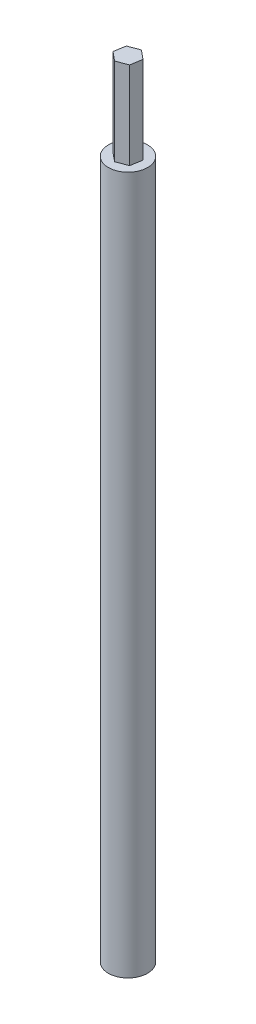
ISO-10303-21;
HEADER;
FILE_DESCRIPTION(('STEP AP214'),'2;1');
FILE_NAME('part.step','',(''),(''),'','','');
FILE_SCHEMA(('AUTOMOTIVE_DESIGN { 1 0 10303 214 1 1 1 1 }'));
ENDSEC;
DATA;
#1=APPLICATION_CONTEXT('core data for automotive mechanical design processes');
#2=APPLICATION_PROTOCOL_DEFINITION('international standard','automotive_design',2000,#1);
#3=PRODUCT_CONTEXT('',#1,'mechanical');
#4=PRODUCT('Part','Part','',(#3));
#5=PRODUCT_RELATED_PRODUCT_CATEGORY('part','',(#4));
#6=PRODUCT_DEFINITION_FORMATION('','',#4);
#7=PRODUCT_DEFINITION_CONTEXT('part definition',#1,'design');
#8=PRODUCT_DEFINITION('design','',#6,#7);
#9=PRODUCT_DEFINITION_SHAPE('','',#8);
#10=(LENGTH_UNIT() NAMED_UNIT(*) SI_UNIT(.MILLI.,.METRE.));
#11=(NAMED_UNIT(*) PLANE_ANGLE_UNIT() SI_UNIT($,.RADIAN.));
#12=(NAMED_UNIT(*) SI_UNIT($,.STERADIAN.) SOLID_ANGLE_UNIT());
#13=UNCERTAINTY_MEASURE_WITH_UNIT(LENGTH_MEASURE(1.E-05),#10,'distance_accuracy_value','');
#14=(GEOMETRIC_REPRESENTATION_CONTEXT(3) GLOBAL_UNCERTAINTY_ASSIGNED_CONTEXT((#13)) GLOBAL_UNIT_ASSIGNED_CONTEXT((#10,
#11,#12)) REPRESENTATION_CONTEXT('',''));
#15=CARTESIAN_POINT('',(0.,0.,0.));
#16=DIRECTION('',(0.,0.,1.));
#17=DIRECTION('',(1.,0.,0.));
#18=AXIS2_PLACEMENT_3D('',#15,#16,#17);
#19=CARTESIAN_POINT('',(0.,0.,0.));
#20=DIRECTION('',(0.,1.,0.));
#21=DIRECTION('',(0.,0.,1.));
#22=AXIS2_PLACEMENT_3D('',#19,#20,#21);
#23=PLANE('',#22);
#24=CARTESIAN_POINT('',(-16.1575589459084,0.,-16.1575589459085));
#25=DIRECTION('',(0.,1.,0.));
#26=DIRECTION('',(0.,0.,1.));
#27=AXIS2_PLACEMENT_3D('',#24,#25,#26);
#28=CIRCLE('',#27,4.5);
#29=CARTESIAN_POINT('',(-16.1575589459084,0.,-11.6575589459085));
#30=VERTEX_POINT('',#29);
#31=EDGE_CURVE('E47',#30,#30,#28,.T.);
#32=ORIENTED_EDGE('',*,*,#31,.F.);
#33=EDGE_LOOP('',(#32));
#34=FACE_BOUND('',#33,.T.);
#35=DIRECTION('',(1.,0.,0.));
#36=VECTOR('',#35,1.);
#37=CARTESIAN_POINT('',(0.,0.,-12.9075589459085));
#38=LINE('',#37,#36);
#39=CARTESIAN_POINT('',(-18.0339473207747,0.,-12.9075589459085));
#40=VERTEX_POINT('',#39);
#41=CARTESIAN_POINT('',(-14.2811705710422,0.,-12.9075589459085));
#42=VERTEX_POINT('',#41);
#43=EDGE_CURVE('E199',#40,#42,#38,.T.);
#44=ORIENTED_EDGE('',*,*,#43,.T.);
#45=DIRECTION('',(0.499999999999999,0.,-0.866025403784439));
#46=VECTOR('',#45,1.);
#47=CARTESIAN_POINT('',(-16.3000149022825,0.,-9.41081799162772));
#48=LINE('',#47,#46);
#49=CARTESIAN_POINT('',(-12.4047821961759,0.,-16.1575589459085));
#50=VERTEX_POINT('',#49);
#51=EDGE_CURVE('E204',#42,#50,#48,.T.);
#52=ORIENTED_EDGE('',*,*,#51,.T.);
#53=DIRECTION('',(-0.5,0.,-0.866025403784439));
#54=VECTOR('',#53,1.);
#55=CARTESIAN_POINT('',(-2.30715839198128,0.,1.3320385186735));
#56=LINE('',#55,#54);
#57=CARTESIAN_POINT('',(-14.2811705710422,0.,-19.4075589459085));
#58=VERTEX_POINT('',#57);
#59=EDGE_CURVE('E238',#50,#58,#56,.T.);
#60=ORIENTED_EDGE('',*,*,#59,.T.);
#61=DIRECTION('',(-1.,0.,0.));
#62=VECTOR('',#61,1.);
#63=CARTESIAN_POINT('',(0.,0.,-19.4075589459085));
#64=LINE('',#63,#62);
#65=CARTESIAN_POINT('',(-18.0339473207747,0.,-19.4075589459085));
#66=VERTEX_POINT('',#65);
#67=EDGE_CURVE('E242',#58,#66,#64,.T.);
#68=ORIENTED_EDGE('',*,*,#67,.T.);
#69=DIRECTION('',(-0.5,0.,0.866025403784439));
#70=VECTOR('',#69,1.);
#71=CARTESIAN_POINT('',(-21.9291800268814,0.,-12.6608179916277));
#72=LINE('',#71,#70);
#73=CARTESIAN_POINT('',(-19.910335695641,0.,-16.1575589459085));
#74=VERTEX_POINT('',#73);
#75=EDGE_CURVE('E246',#66,#74,#72,.T.);
#76=ORIENTED_EDGE('',*,*,#75,.T.);
#77=DIRECTION('',(0.5,0.,0.866025403784439));
#78=VECTOR('',#77,1.);
#79=CARTESIAN_POINT('',(-7.93632351658015,0.,4.5820385186735));
#80=LINE('',#79,#78);
#81=EDGE_CURVE('E215',#74,#40,#80,.T.);
#82=ORIENTED_EDGE('',*,*,#81,.T.);
#83=EDGE_LOOP('',(#44,#52,#60,#68,#76,#82));
#84=FACE_BOUND('',#83,.T.);
#85=ADVANCED_FACE('F43',(#34,#84),#23,.F.);
#86=CARTESIAN_POINT('',(-16.1575589459084,160.,-16.1575589459085));
#87=DIRECTION('',(0.,-1.,0.));
#88=DIRECTION('',(0.,0.,-1.));
#89=AXIS2_PLACEMENT_3D('',#86,#87,#88);
#90=CYLINDRICAL_SURFACE('',#89,4.5);
#91=CARTESIAN_POINT('',(-16.1575589459084,160.,-16.1575589459085));
#92=DIRECTION('',(0.,1.,0.));
#93=DIRECTION('',(0.,0.,1.));
#94=AXIS2_PLACEMENT_3D('',#91,#92,#93);
#95=CIRCLE('',#94,4.5);
#96=CARTESIAN_POINT('',(-16.1575589459084,160.,-11.6575589459085));
#97=VERTEX_POINT('',#96);
#98=EDGE_CURVE('E272',#97,#97,#95,.T.);
#99=ORIENTED_EDGE('',*,*,#98,.F.);
#100=EDGE_LOOP('',(#99));
#101=FACE_BOUND('',#100,.T.);
#102=ORIENTED_EDGE('',*,*,#31,.T.);
#103=EDGE_LOOP('',(#102));
#104=FACE_BOUND('',#103,.T.);
#105=ADVANCED_FACE('F45',(#101,#104),#90,.T.);
#106=CARTESIAN_POINT('',(-16.1575589459084,160.,-16.1575589459085));
#107=DIRECTION('',(0.,-1.,0.));
#108=DIRECTION('',(0.,0.,-1.));
#109=AXIS2_PLACEMENT_3D('',#106,#107,#108);
#110=CYLINDRICAL_SURFACE('',#109,2.31428571428571);
#111=CARTESIAN_POINT('',(-16.1575589459084,5.,-16.1575589459085));
#112=DIRECTION('',(0.,1.,0.));
#113=DIRECTION('',(0.,0.,1.));
#114=AXIS2_PLACEMENT_3D('',#111,#112,#113);
#115=CIRCLE('',#114,2.31428571428571);
#116=CARTESIAN_POINT('',(-16.1575589459084,5.,-13.8432732316228));
#117=VERTEX_POINT('',#116);
#118=EDGE_CURVE('E210',#117,#117,#115,.T.);
#119=ORIENTED_EDGE('',*,*,#118,.F.);
#120=EDGE_LOOP('',(#119));
#121=FACE_BOUND('',#120,.T.);
#122=CARTESIAN_POINT('',(-16.1575589459084,160.,-16.1575589459085));
#123=DIRECTION('',(0.,1.,0.));
#124=DIRECTION('',(0.,0.,1.));
#125=AXIS2_PLACEMENT_3D('',#122,#123,#124);
#126=CIRCLE('',#125,2.31428571428571);
#127=CARTESIAN_POINT('',(-15.3935069026118,160.,-13.9730354641209));
#128=VERTEX_POINT('',#127);
#129=CARTESIAN_POINT('',(-15.2912215587246,160.,-14.0115445240291));
#130=VERTEX_POINT('',#129);
#131=EDGE_CURVE('E276',#128,#130,#126,.T.);
#132=ORIENTED_EDGE('',*,*,#131,.T.);
#133=CARTESIAN_POINT('',(-13.8836800938685,160.,-15.726985684323));
#134=VERTEX_POINT('',#133);
#135=EDGE_CURVE('E280',#130,#134,#126,.T.);
#136=ORIENTED_EDGE('',*,*,#135,.T.);
#137=CARTESIAN_POINT('',(-13.8658872460812,160.,-15.8348219205183));
#138=VERTEX_POINT('',#137);
#139=EDGE_CURVE('E288',#134,#138,#126,.T.);
#140=ORIENTED_EDGE('',*,*,#139,.T.);
#141=CARTESIAN_POINT('',(-14.6477321371649,160.,-17.9115091661104));
#142=VERTEX_POINT('',#141);
#143=EDGE_CURVE('E317',#138,#142,#126,.T.);
#144=ORIENTED_EDGE('',*,*,#143,.T.);
#145=CARTESIAN_POINT('',(-14.7322246332653,160.,-17.9808363423978));
#146=VERTEX_POINT('',#145);
#147=EDGE_CURVE('E312',#142,#146,#126,.T.);
#148=ORIENTED_EDGE('',*,*,#147,.T.);
#149=CARTESIAN_POINT('',(-16.9216109892048,160.,-18.3420824276961));
#150=VERTEX_POINT('',#149);
#151=EDGE_CURVE('E309',#146,#150,#126,.T.);
#152=ORIENTED_EDGE('',*,*,#151,.T.);
#153=CARTESIAN_POINT('',(-17.0238963330926,160.,-18.3035733677877));
#154=VERTEX_POINT('',#153);
#155=EDGE_CURVE('E304',#150,#154,#126,.T.);
#156=ORIENTED_EDGE('',*,*,#155,.T.);
#157=CARTESIAN_POINT('',(-18.4314377979484,160.,-16.5881322074942));
#158=VERTEX_POINT('',#157);
#159=EDGE_CURVE('E301',#154,#158,#126,.T.);
#160=ORIENTED_EDGE('',*,*,#159,.T.);
#161=CARTESIAN_POINT('',(-18.4492306457358,160.,-16.4802959712984));
#162=VERTEX_POINT('',#161);
#163=EDGE_CURVE('E296',#158,#162,#126,.T.);
#164=ORIENTED_EDGE('',*,*,#163,.T.);
#165=CARTESIAN_POINT('',(-17.6673857546518,160.,-14.4036087257064));
#166=VERTEX_POINT('',#165);
#167=EDGE_CURVE('E293',#162,#166,#126,.T.);
#168=ORIENTED_EDGE('',*,*,#167,.T.);
#169=CARTESIAN_POINT('',(-17.5828932585518,160.,-14.3342815494193));
#170=VERTEX_POINT('',#169);
#171=EDGE_CURVE('E290',#166,#170,#126,.T.);
#172=ORIENTED_EDGE('',*,*,#171,.T.);
#173=EDGE_CURVE('E275',#170,#128,#126,.T.);
#174=ORIENTED_EDGE('',*,*,#173,.T.);
#175=EDGE_LOOP('',(#132,#136,#140,#144,#148,#152,#156,#160,#164,#168,#172,#174));
#176=FACE_BOUND('',#175,.T.);
#177=ADVANCED_FACE('F324',(#121,#176),#110,.F.);
#178=CARTESIAN_POINT('',(0.,160.,0.));
#179=DIRECTION('',(0.,1.,0.));
#180=DIRECTION('',(0.,0.,1.));
#181=AXIS2_PLACEMENT_3D('',#178,#179,#180);
#182=PLANE('',#181);
#183=DIRECTION('',(0.935870984996872,0.,-0.35234287198833));
#184=VECTOR('',#183,1.);
#185=CARTESIAN_POINT('',(-16.5924828428772,160.,-13.5216371057891));
#186=LINE('',#185,#184);
#187=CARTESIAN_POINT('',(-16.5924828428772,160.,-13.5216371057891));
#188=VERTEX_POINT('',#187);
#189=EDGE_CURVE('E333',#188,#128,#186,.T.);
#190=ORIENTED_EDGE('',*,*,#189,.F.);
#191=DIRECTION('',(0.773073370482697,0.,0.634316611677893));
#192=VECTOR('',#191,1.);
#193=CARTESIAN_POINT('',(-18.6577961703264,160.,-15.2162531693366));
#194=LINE('',#193,#192);
#195=EDGE_CURVE('E11',#170,#188,#194,.T.);
#196=ORIENTED_EDGE('',*,*,#195,.F.);
#197=ORIENTED_EDGE('',*,*,#171,.F.);
#198=CARTESIAN_POINT('',(-18.6577961703264,160.,-15.2162531693366));
#199=VERTEX_POINT('',#198);
#200=EDGE_CURVE('E55',#199,#166,#194,.T.);
#201=ORIENTED_EDGE('',*,*,#200,.F.);
#202=DIRECTION('',(-0.162797614514173,0.,0.986659483666221));
#203=VECTOR('',#202,1.);
#204=CARTESIAN_POINT('',(-18.2228722733577,160.,-17.852175009456));
#205=LINE('',#204,#203);
#206=EDGE_CURVE('E53',#162,#199,#205,.T.);
#207=ORIENTED_EDGE('',*,*,#206,.F.);
#208=ORIENTED_EDGE('',*,*,#163,.F.);
#209=CARTESIAN_POINT('',(-18.2228722733577,160.,-17.852175009456));
#210=VERTEX_POINT('',#209);
#211=EDGE_CURVE('E351',#210,#158,#205,.T.);
#212=ORIENTED_EDGE('',*,*,#211,.F.);
#213=DIRECTION('',(-0.935870984996872,0.,0.35234287198833));
#214=VECTOR('',#213,1.);
#215=CARTESIAN_POINT('',(-15.7226350489397,160.,-18.7934807860279));
#216=LINE('',#215,#214);
#217=EDGE_CURVE('E350',#154,#210,#216,.T.);
#218=ORIENTED_EDGE('',*,*,#217,.F.);
#219=ORIENTED_EDGE('',*,*,#155,.F.);
#220=CARTESIAN_POINT('',(-15.7226350489397,160.,-18.7934807860279));
#221=VERTEX_POINT('',#220);
#222=EDGE_CURVE('E345',#221,#150,#216,.T.);
#223=ORIENTED_EDGE('',*,*,#222,.F.);
#224=DIRECTION('',(-0.773073370482698,0.,-0.634316611677892));
#225=VECTOR('',#224,1.);
#226=CARTESIAN_POINT('',(-13.6573217214905,160.,-17.0988647224803));
#227=LINE('',#226,#225);
#228=EDGE_CURVE('E344',#146,#221,#227,.T.);
#229=ORIENTED_EDGE('',*,*,#228,.F.);
#230=ORIENTED_EDGE('',*,*,#147,.F.);
#231=CARTESIAN_POINT('',(-13.6573217214905,160.,-17.0988647224803));
#232=VERTEX_POINT('',#231);
#233=EDGE_CURVE('E340',#232,#142,#227,.T.);
#234=ORIENTED_EDGE('',*,*,#233,.F.);
#235=DIRECTION('',(0.162797614514173,0.,-0.986659483666222));
#236=VECTOR('',#235,1.);
#237=CARTESIAN_POINT('',(-14.0922456184592,160.,-14.4629428823609));
#238=LINE('',#237,#236);
#239=EDGE_CURVE('E279',#138,#232,#238,.T.);
#240=ORIENTED_EDGE('',*,*,#239,.F.);
#241=ORIENTED_EDGE('',*,*,#139,.F.);
#242=CARTESIAN_POINT('',(-14.0922456184592,160.,-14.4629428823609));
#243=VERTEX_POINT('',#242);
#244=EDGE_CURVE('E63',#243,#134,#238,.T.);
#245=ORIENTED_EDGE('',*,*,#244,.F.);
#246=EDGE_CURVE('E197',#130,#243,#186,.T.);
#247=ORIENTED_EDGE('',*,*,#246,.F.);
#248=ORIENTED_EDGE('',*,*,#131,.F.);
#249=EDGE_LOOP('',(#190,#196,#197,#201,#207,#208,#212,#218,#219,#223,#229,#230,#234,#240,#241,
#245,#247,#248));
#250=FACE_BOUND('',#249,.T.);
#251=ORIENTED_EDGE('',*,*,#98,.T.);
#252=EDGE_LOOP('',(#251));
#253=FACE_BOUND('',#252,.T.);
#254=ADVANCED_FACE('F405',(#250,#253),#182,.T.);
#255=CARTESIAN_POINT('',(0.,5.,-12.9075589459085));
#256=DIRECTION('',(0.,0.,-1.));
#257=DIRECTION('',(-1.,0.,0.));
#258=AXIS2_PLACEMENT_3D('',#255,#256,#257);
#259=PLANE('',#258);
#260=ORIENTED_EDGE('',*,*,#43,.F.);
#261=DIRECTION('',(0.,-1.,0.));
#262=VECTOR('',#261,1.);
#263=CARTESIAN_POINT('',(-18.0339473207747,5.,-12.9075589459085));
#264=LINE('',#263,#262);
#265=CARTESIAN_POINT('',(-18.0339473207747,5.,-12.9075589459085));
#266=VERTEX_POINT('',#265);
#267=EDGE_CURVE('E233',#266,#40,#264,.T.);
#268=ORIENTED_EDGE('',*,*,#267,.F.);
#269=DIRECTION('',(1.,0.,0.));
#270=VECTOR('',#269,1.);
#271=CARTESIAN_POINT('',(0.,5.,-12.9075589459085));
#272=LINE('',#271,#270);
#273=CARTESIAN_POINT('',(-14.2811705710422,5.,-12.9075589459085));
#274=VERTEX_POINT('',#273);
#275=EDGE_CURVE('E214',#266,#274,#272,.T.);
#276=ORIENTED_EDGE('',*,*,#275,.T.);
#277=DIRECTION('',(0.,-1.,0.));
#278=VECTOR('',#277,1.);
#279=CARTESIAN_POINT('',(-14.2811705710422,5.,-12.9075589459085));
#280=LINE('',#279,#278);
#281=EDGE_CURVE('E268',#274,#42,#280,.T.);
#282=ORIENTED_EDGE('',*,*,#281,.T.);
#283=EDGE_LOOP('',(#260,#268,#276,#282));
#284=FACE_BOUND('',#283,.T.);
#285=ADVANCED_FACE('F410',(#284),#259,.T.);
#286=CARTESIAN_POINT('',(-16.3000149022825,5.,-9.41081799162772));
#287=DIRECTION('',(-0.866025403784439,0.,-0.499999999999999));
#288=DIRECTION('',(-0.499999999999999,0.,0.866025403784439));
#289=AXIS2_PLACEMENT_3D('',#286,#287,#288);
#290=PLANE('',#289);
#291=ORIENTED_EDGE('',*,*,#51,.F.);
#292=ORIENTED_EDGE('',*,*,#281,.F.);
#293=DIRECTION('',(0.499999999999999,0.,-0.866025403784439));
#294=VECTOR('',#293,1.);
#295=CARTESIAN_POINT('',(-16.3000149022825,5.,-9.41081799162772));
#296=LINE('',#295,#294);
#297=CARTESIAN_POINT('',(-12.4047821961759,5.,-16.1575589459085));
#298=VERTEX_POINT('',#297);
#299=EDGE_CURVE('E219',#274,#298,#296,.T.);
#300=ORIENTED_EDGE('',*,*,#299,.T.);
#301=DIRECTION('',(0.,-1.,0.));
#302=VECTOR('',#301,1.);
#303=CARTESIAN_POINT('',(-12.4047821961759,5.,-16.1575589459085));
#304=LINE('',#303,#302);
#305=EDGE_CURVE('E265',#298,#50,#304,.T.);
#306=ORIENTED_EDGE('',*,*,#305,.T.);
#307=EDGE_LOOP('',(#291,#292,#300,#306));
#308=FACE_BOUND('',#307,.T.);
#309=ADVANCED_FACE('F438',(#308),#290,.T.);
#310=CARTESIAN_POINT('',(-2.30715839198128,5.,1.3320385186735));
#311=DIRECTION('',(-0.866025403784439,0.,0.5));
#312=DIRECTION('',(0.5,0.,0.866025403784439));
#313=AXIS2_PLACEMENT_3D('',#310,#311,#312);
#314=PLANE('',#313);
#315=ORIENTED_EDGE('',*,*,#59,.F.);
#316=ORIENTED_EDGE('',*,*,#305,.F.);
#317=DIRECTION('',(-0.5,0.,-0.866025403784439));
#318=VECTOR('',#317,1.);
#319=CARTESIAN_POINT('',(-2.30715839198128,5.,1.3320385186735));
#320=LINE('',#319,#318);
#321=CARTESIAN_POINT('',(-14.2811705710422,5.,-19.4075589459085));
#322=VERTEX_POINT('',#321);
#323=EDGE_CURVE('E222',#298,#322,#320,.T.);
#324=ORIENTED_EDGE('',*,*,#323,.T.);
#325=DIRECTION('',(0.,-1.,0.));
#326=VECTOR('',#325,1.);
#327=CARTESIAN_POINT('',(-14.2811705710422,5.,-19.4075589459085));
#328=LINE('',#327,#326);
#329=EDGE_CURVE('E262',#322,#58,#328,.T.);
#330=ORIENTED_EDGE('',*,*,#329,.T.);
#331=EDGE_LOOP('',(#315,#316,#324,#330));
#332=FACE_BOUND('',#331,.T.);
#333=ADVANCED_FACE('F442',(#332),#314,.T.);
#334=CARTESIAN_POINT('',(0.,5.,-19.4075589459085));
#335=DIRECTION('',(0.,0.,1.));
#336=DIRECTION('',(1.,0.,0.));
#337=AXIS2_PLACEMENT_3D('',#334,#335,#336);
#338=PLANE('',#337);
#339=ORIENTED_EDGE('',*,*,#67,.F.);
#340=ORIENTED_EDGE('',*,*,#329,.F.);
#341=DIRECTION('',(-1.,0.,0.));
#342=VECTOR('',#341,1.);
#343=CARTESIAN_POINT('',(0.,5.,-19.4075589459085));
#344=LINE('',#343,#342);
#345=CARTESIAN_POINT('',(-18.0339473207747,5.,-19.4075589459085));
#346=VERTEX_POINT('',#345);
#347=EDGE_CURVE('E225',#322,#346,#344,.T.);
#348=ORIENTED_EDGE('',*,*,#347,.T.);
#349=DIRECTION('',(0.,-1.,0.));
#350=VECTOR('',#349,1.);
#351=CARTESIAN_POINT('',(-18.0339473207747,5.,-19.4075589459085));
#352=LINE('',#351,#350);
#353=EDGE_CURVE('E259',#346,#66,#352,.T.);
#354=ORIENTED_EDGE('',*,*,#353,.T.);
#355=EDGE_LOOP('',(#339,#340,#348,#354));
#356=FACE_BOUND('',#355,.T.);
#357=ADVANCED_FACE('F447',(#356),#338,.T.);
#358=CARTESIAN_POINT('',(-21.9291800268814,5.,-12.6608179916277));
#359=DIRECTION('',(0.866025403784439,0.,0.5));
#360=DIRECTION('',(0.5,0.,-0.866025403784439));
#361=AXIS2_PLACEMENT_3D('',#358,#359,#360);
#362=PLANE('',#361);
#363=ORIENTED_EDGE('',*,*,#75,.F.);
#364=ORIENTED_EDGE('',*,*,#353,.F.);
#365=DIRECTION('',(-0.5,0.,0.866025403784439));
#366=VECTOR('',#365,1.);
#367=CARTESIAN_POINT('',(-21.9291800268814,5.,-12.6608179916277));
#368=LINE('',#367,#366);
#369=CARTESIAN_POINT('',(-19.910335695641,5.,-16.1575589459085));
#370=VERTEX_POINT('',#369);
#371=EDGE_CURVE('E228',#346,#370,#368,.T.);
#372=ORIENTED_EDGE('',*,*,#371,.T.);
#373=DIRECTION('',(0.,-1.,0.));
#374=VECTOR('',#373,1.);
#375=CARTESIAN_POINT('',(-19.910335695641,5.,-16.1575589459085));
#376=LINE('',#375,#374);
#377=EDGE_CURVE('E256',#370,#74,#376,.T.);
#378=ORIENTED_EDGE('',*,*,#377,.T.);
#379=EDGE_LOOP('',(#363,#364,#372,#378));
#380=FACE_BOUND('',#379,.T.);
#381=ADVANCED_FACE('F450',(#380),#362,.T.);
#382=CARTESIAN_POINT('',(-7.93632351658015,5.,4.5820385186735));
#383=DIRECTION('',(0.866025403784439,0.,-0.5));
#384=DIRECTION('',(-0.5,0.,-0.866025403784439));
#385=AXIS2_PLACEMENT_3D('',#382,#383,#384);
#386=PLANE('',#385);
#387=ORIENTED_EDGE('',*,*,#81,.F.);
#388=ORIENTED_EDGE('',*,*,#377,.F.);
#389=DIRECTION('',(0.5,0.,0.866025403784439));
#390=VECTOR('',#389,1.);
#391=CARTESIAN_POINT('',(-7.93632351658015,5.,4.5820385186735));
#392=LINE('',#391,#390);
#393=EDGE_CURVE('E231',#370,#266,#392,.T.);
#394=ORIENTED_EDGE('',*,*,#393,.T.);
#395=ORIENTED_EDGE('',*,*,#267,.T.);
#396=EDGE_LOOP('',(#387,#388,#394,#395));
#397=FACE_BOUND('',#396,.T.);
#398=ADVANCED_FACE('F429',(#397),#386,.T.);
#399=CARTESIAN_POINT('',(0.,5.,0.));
#400=DIRECTION('',(0.,1.,0.));
#401=DIRECTION('',(0.,0.,1.));
#402=AXIS2_PLACEMENT_3D('',#399,#400,#401);
#403=PLANE('',#402);
#404=ORIENTED_EDGE('',*,*,#118,.T.);
#405=EDGE_LOOP('',(#404));
#406=FACE_BOUND('',#405,.T.);
#407=ORIENTED_EDGE('',*,*,#275,.F.);
#408=ORIENTED_EDGE('',*,*,#393,.F.);
#409=ORIENTED_EDGE('',*,*,#371,.F.);
#410=ORIENTED_EDGE('',*,*,#347,.F.);
#411=ORIENTED_EDGE('',*,*,#323,.F.);
#412=ORIENTED_EDGE('',*,*,#299,.F.);
#413=EDGE_LOOP('',(#407,#408,#409,#410,#411,#412));
#414=FACE_BOUND('',#413,.T.);
#415=ADVANCED_FACE('F434',(#406,#414),#403,.F.);
#416=CARTESIAN_POINT('',(-16.5924828428772,180.,-13.5216371057891));
#417=DIRECTION('',(-0.35234287198833,0.,-0.935870984996872));
#418=DIRECTION('',(-0.935870984996872,0.,0.35234287198833));
#419=AXIS2_PLACEMENT_3D('',#416,#417,#418);
#420=PLANE('',#419);
#421=ORIENTED_EDGE('',*,*,#189,.T.);
#422=EDGE_CURVE('E336',#128,#130,#186,.T.);
#423=ORIENTED_EDGE('',*,*,#422,.T.);
#424=ORIENTED_EDGE('',*,*,#246,.T.);
#425=DIRECTION('',(0.,-1.,0.));
#426=VECTOR('',#425,1.);
#427=CARTESIAN_POINT('',(-14.0922456184592,180.,-14.4629428823609));
#428=LINE('',#427,#426);
#429=CARTESIAN_POINT('',(-14.0922456184592,180.,-14.4629428823609));
#430=VERTEX_POINT('',#429);
#431=EDGE_CURVE('E175',#430,#243,#428,.T.);
#432=ORIENTED_EDGE('',*,*,#431,.F.);
#433=DIRECTION('',(0.935870984996872,0.,-0.35234287198833));
#434=VECTOR('',#433,1.);
#435=CARTESIAN_POINT('',(-16.5924828428772,180.,-13.5216371057891));
#436=LINE('',#435,#434);
#437=CARTESIAN_POINT('',(-16.5924828428772,180.,-13.5216371057891));
#438=VERTEX_POINT('',#437);
#439=EDGE_CURVE('E183',#438,#430,#436,.T.);
#440=ORIENTED_EDGE('',*,*,#439,.F.);
#441=DIRECTION('',(0.,-1.,0.));
#442=VECTOR('',#441,1.);
#443=CARTESIAN_POINT('',(-16.5924828428772,180.,-13.5216371057891));
#444=LINE('',#443,#442);
#445=EDGE_CURVE('E357',#438,#188,#444,.T.);
#446=ORIENTED_EDGE('',*,*,#445,.T.);
#447=EDGE_LOOP('',(#421,#423,#424,#432,#440,#446));
#448=FACE_BOUND('',#447,.T.);
#449=ADVANCED_FACE('F195',(#448),#420,.F.);
#450=CARTESIAN_POINT('',(-14.0922456184592,180.,-14.4629428823609));
#451=DIRECTION('',(-0.986659483666221,0.,-0.162797614514173));
#452=DIRECTION('',(-0.162797614514173,0.,0.986659483666221));
#453=AXIS2_PLACEMENT_3D('',#450,#451,#452);
#454=PLANE('',#453);
#455=ORIENTED_EDGE('',*,*,#244,.T.);
#456=EDGE_CURVE('E287',#134,#138,#238,.T.);
#457=ORIENTED_EDGE('',*,*,#456,.T.);
#458=ORIENTED_EDGE('',*,*,#239,.T.);
#459=DIRECTION('',(0.,-1.,0.));
#460=VECTOR('',#459,1.);
#461=CARTESIAN_POINT('',(-13.6573217214905,180.,-17.0988647224803));
#462=LINE('',#461,#460);
#463=CARTESIAN_POINT('',(-13.6573217214905,180.,-17.0988647224803));
#464=VERTEX_POINT('',#463);
#465=EDGE_CURVE('E178',#464,#232,#462,.T.);
#466=ORIENTED_EDGE('',*,*,#465,.F.);
#467=DIRECTION('',(0.162797614514173,0.,-0.986659483666222));
#468=VECTOR('',#467,1.);
#469=CARTESIAN_POINT('',(-14.0922456184592,180.,-14.4629428823609));
#470=LINE('',#469,#468);
#471=EDGE_CURVE('E171',#430,#464,#470,.T.);
#472=ORIENTED_EDGE('',*,*,#471,.F.);
#473=ORIENTED_EDGE('',*,*,#431,.T.);
#474=EDGE_LOOP('',(#455,#457,#458,#466,#472,#473));
#475=FACE_BOUND('',#474,.T.);
#476=ADVANCED_FACE('F173',(#475),#454,.F.);
#477=CARTESIAN_POINT('',(-13.6573217214905,180.,-17.0988647224803));
#478=DIRECTION('',(-0.634316611677892,0.,0.773073370482698));
#479=DIRECTION('',(0.773073370482698,0.,0.634316611677892));
#480=AXIS2_PLACEMENT_3D('',#477,#478,#479);
#481=PLANE('',#480);
#482=ORIENTED_EDGE('',*,*,#233,.T.);
#483=EDGE_CURVE('E330',#142,#146,#227,.T.);
#484=ORIENTED_EDGE('',*,*,#483,.T.);
#485=ORIENTED_EDGE('',*,*,#228,.T.);
#486=DIRECTION('',(0.,-1.,0.));
#487=VECTOR('',#486,1.);
#488=CARTESIAN_POINT('',(-15.7226350489397,180.,-18.7934807860279));
#489=LINE('',#488,#487);
#490=CARTESIAN_POINT('',(-15.7226350489397,180.,-18.7934807860279));
#491=VERTEX_POINT('',#490);
#492=EDGE_CURVE('E206',#491,#221,#489,.T.);
#493=ORIENTED_EDGE('',*,*,#492,.F.);
#494=DIRECTION('',(-0.773073370482698,0.,-0.634316611677892));
#495=VECTOR('',#494,1.);
#496=CARTESIAN_POINT('',(-13.6573217214905,180.,-17.0988647224803));
#497=LINE('',#496,#495);
#498=EDGE_CURVE('E182',#464,#491,#497,.T.);
#499=ORIENTED_EDGE('',*,*,#498,.F.);
#500=ORIENTED_EDGE('',*,*,#465,.T.);
#501=EDGE_LOOP('',(#482,#484,#485,#493,#499,#500));
#502=FACE_BOUND('',#501,.T.);
#503=ADVANCED_FACE('F378',(#502),#481,.F.);
#504=CARTESIAN_POINT('',(-15.7226350489397,180.,-18.7934807860279));
#505=DIRECTION('',(0.35234287198833,0.,0.935870984996872));
#506=DIRECTION('',(0.935870984996872,0.,-0.35234287198833));
#507=AXIS2_PLACEMENT_3D('',#504,#505,#506);
#508=PLANE('',#507);
#509=ORIENTED_EDGE('',*,*,#222,.T.);
#510=EDGE_CURVE('E343',#150,#154,#216,.T.);
#511=ORIENTED_EDGE('',*,*,#510,.T.);
#512=ORIENTED_EDGE('',*,*,#217,.T.);
#513=DIRECTION('',(0.,-1.,0.));
#514=VECTOR('',#513,1.);
#515=CARTESIAN_POINT('',(-18.2228722733577,180.,-17.852175009456));
#516=LINE('',#515,#514);
#517=CARTESIAN_POINT('',(-18.2228722733577,180.,-17.852175009456));
#518=VERTEX_POINT('',#517);
#519=EDGE_CURVE('E364',#518,#210,#516,.T.);
#520=ORIENTED_EDGE('',*,*,#519,.F.);
#521=DIRECTION('',(-0.935870984996872,0.,0.35234287198833));
#522=VECTOR('',#521,1.);
#523=CARTESIAN_POINT('',(-15.7226350489397,180.,-18.7934807860279));
#524=LINE('',#523,#522);
#525=EDGE_CURVE('E375',#491,#518,#524,.T.);
#526=ORIENTED_EDGE('',*,*,#525,.F.);
#527=ORIENTED_EDGE('',*,*,#492,.T.);
#528=EDGE_LOOP('',(#509,#511,#512,#520,#526,#527));
#529=FACE_BOUND('',#528,.T.);
#530=ADVANCED_FACE('F372',(#529),#508,.F.);
#531=CARTESIAN_POINT('',(-18.2228722733577,180.,-17.852175009456));
#532=DIRECTION('',(0.986659483666221,0.,0.162797614514173));
#533=DIRECTION('',(0.162797614514173,0.,-0.986659483666221));
#534=AXIS2_PLACEMENT_3D('',#531,#532,#533);
#535=PLANE('',#534);
#536=ORIENTED_EDGE('',*,*,#211,.T.);
#537=EDGE_CURVE('E349',#158,#162,#205,.T.);
#538=ORIENTED_EDGE('',*,*,#537,.T.);
#539=ORIENTED_EDGE('',*,*,#206,.T.);
#540=DIRECTION('',(0.,-1.,0.));
#541=VECTOR('',#540,1.);
#542=CARTESIAN_POINT('',(-18.6577961703264,180.,-15.2162531693366));
#543=LINE('',#542,#541);
#544=CARTESIAN_POINT('',(-18.6577961703264,180.,-15.2162531693366));
#545=VERTEX_POINT('',#544);
#546=EDGE_CURVE('E360',#545,#199,#543,.T.);
#547=ORIENTED_EDGE('',*,*,#546,.F.);
#548=DIRECTION('',(-0.162797614514173,0.,0.986659483666221));
#549=VECTOR('',#548,1.);
#550=CARTESIAN_POINT('',(-18.2228722733577,180.,-17.852175009456));
#551=LINE('',#550,#549);
#552=EDGE_CURVE('E393',#518,#545,#551,.T.);
#553=ORIENTED_EDGE('',*,*,#552,.F.);
#554=ORIENTED_EDGE('',*,*,#519,.T.);
#555=EDGE_LOOP('',(#536,#538,#539,#547,#553,#554));
#556=FACE_BOUND('',#555,.T.);
#557=ADVANCED_FACE('F401',(#556),#535,.F.);
#558=CARTESIAN_POINT('',(-18.6577961703264,180.,-15.2162531693366));
#559=DIRECTION('',(0.634316611677893,0.,-0.773073370482697));
#560=DIRECTION('',(-0.773073370482697,0.,-0.634316611677893));
#561=AXIS2_PLACEMENT_3D('',#558,#559,#560);
#562=PLANE('',#561);
#563=ORIENTED_EDGE('',*,*,#200,.T.);
#564=EDGE_CURVE('E56',#166,#170,#194,.T.);
#565=ORIENTED_EDGE('',*,*,#564,.T.);
#566=ORIENTED_EDGE('',*,*,#195,.T.);
#567=ORIENTED_EDGE('',*,*,#445,.F.);
#568=DIRECTION('',(0.773073370482697,0.,0.634316611677893));
#569=VECTOR('',#568,1.);
#570=CARTESIAN_POINT('',(-18.6577961703264,180.,-15.2162531693366));
#571=LINE('',#570,#569);
#572=EDGE_CURVE('E188',#545,#438,#571,.T.);
#573=ORIENTED_EDGE('',*,*,#572,.F.);
#574=ORIENTED_EDGE('',*,*,#546,.T.);
#575=EDGE_LOOP('',(#563,#565,#566,#567,#573,#574));
#576=FACE_BOUND('',#575,.T.);
#577=ADVANCED_FACE('F403',(#576),#562,.F.);
#578=CARTESIAN_POINT('',(0.,180.,0.));
#579=DIRECTION('',(0.,1.,0.));
#580=DIRECTION('',(0.,0.,1.));
#581=AXIS2_PLACEMENT_3D('',#578,#579,#580);
#582=PLANE('',#581);
#583=ORIENTED_EDGE('',*,*,#439,.T.);
#584=ORIENTED_EDGE('',*,*,#471,.T.);
#585=ORIENTED_EDGE('',*,*,#498,.T.);
#586=ORIENTED_EDGE('',*,*,#525,.T.);
#587=ORIENTED_EDGE('',*,*,#552,.T.);
#588=ORIENTED_EDGE('',*,*,#572,.T.);
#589=EDGE_LOOP('',(#583,#584,#585,#586,#587,#588));
#590=FACE_BOUND('',#589,.T.);
#591=ADVANCED_FACE('F186',(#590),#582,.T.);
#592=CARTESIAN_POINT('',(0.,160.,0.));
#593=DIRECTION('',(0.,1.,0.));
#594=DIRECTION('',(0.,0.,1.));
#595=AXIS2_PLACEMENT_3D('',#592,#593,#594);
#596=PLANE('',#595);
#597=ORIENTED_EDGE('',*,*,#135,.F.);
#598=ORIENTED_EDGE('',*,*,#422,.F.);
#599=ORIENTED_EDGE('',*,*,#173,.F.);
#600=ORIENTED_EDGE('',*,*,#564,.F.);
#601=ORIENTED_EDGE('',*,*,#167,.F.);
#602=ORIENTED_EDGE('',*,*,#537,.F.);
#603=ORIENTED_EDGE('',*,*,#159,.F.);
#604=ORIENTED_EDGE('',*,*,#510,.F.);
#605=ORIENTED_EDGE('',*,*,#151,.F.);
#606=ORIENTED_EDGE('',*,*,#483,.F.);
#607=ORIENTED_EDGE('',*,*,#143,.F.);
#608=ORIENTED_EDGE('',*,*,#456,.F.);
#609=EDGE_LOOP('',(#597,#598,#599,#600,#601,#602,#603,#604,#605,#606,#607,#608));
#610=FACE_BOUND('',#609,.T.);
#611=ADVANCED_FACE('F328',(#610),#596,.F.);
#612=CLOSED_SHELL('',(#85,#105,#177,#254,#285,#309,#333,#357,#381,#398,#415,#449,#476,#503,#530,
#557,#577,#591,#611));
#613=MANIFOLD_SOLID_BREP('B2',#612);
#614=ADVANCED_BREP_SHAPE_REPRESENTATION('',(#18,#613),#14);
#615=SHAPE_DEFINITION_REPRESENTATION(#9,#614);
ENDSEC;
END-ISO-10303-21;
